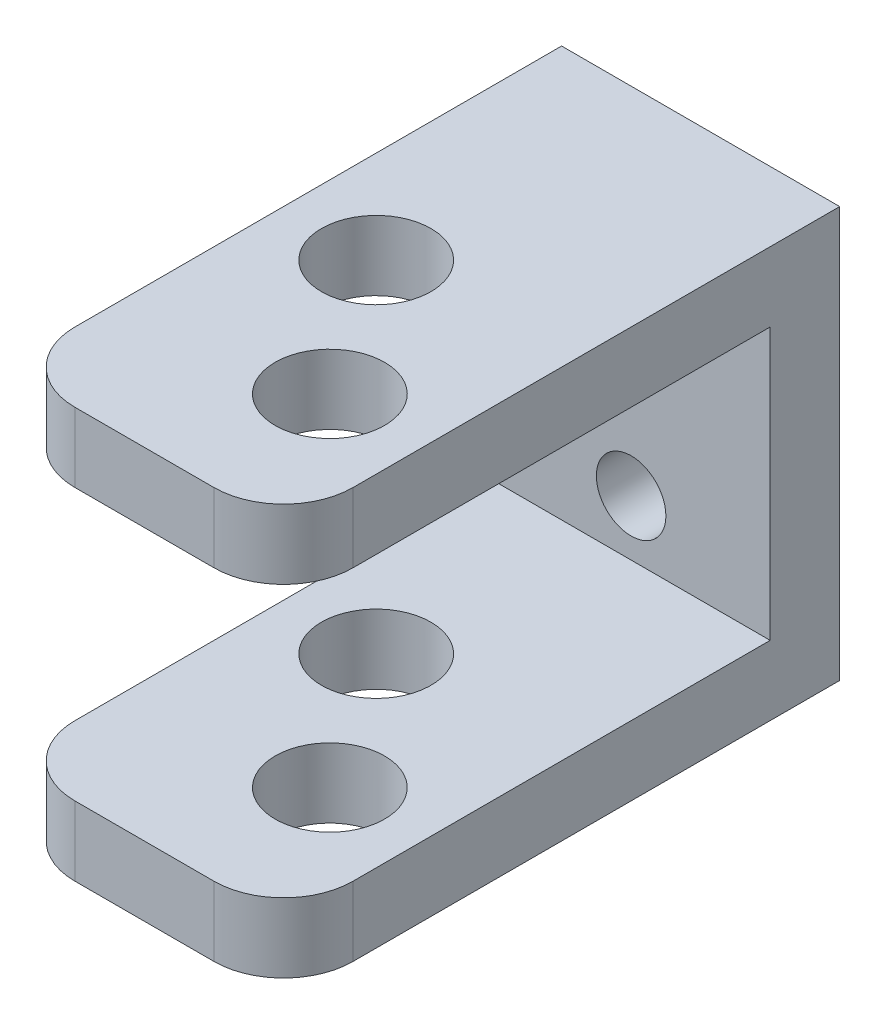
ISO-10303-21;
HEADER;
FILE_DESCRIPTION(('STEP AP214'),'2;1');
FILE_NAME('part.step','',(''),(''),'','','');
FILE_SCHEMA(('AUTOMOTIVE_DESIGN { 1 0 10303 214 1 1 1 1 }'));
ENDSEC;
DATA;
#1=APPLICATION_CONTEXT('core data for automotive mechanical design processes');
#2=APPLICATION_PROTOCOL_DEFINITION('international standard','automotive_design',2000,#1);
#3=PRODUCT_CONTEXT('',#1,'mechanical');
#4=PRODUCT('Part','Part','',(#3));
#5=PRODUCT_RELATED_PRODUCT_CATEGORY('part','',(#4));
#6=PRODUCT_DEFINITION_FORMATION('','',#4);
#7=PRODUCT_DEFINITION_CONTEXT('part definition',#1,'design');
#8=PRODUCT_DEFINITION('design','',#6,#7);
#9=PRODUCT_DEFINITION_SHAPE('','',#8);
#10=(LENGTH_UNIT() NAMED_UNIT(*) SI_UNIT(.MILLI.,.METRE.));
#11=(NAMED_UNIT(*) PLANE_ANGLE_UNIT() SI_UNIT($,.RADIAN.));
#12=(NAMED_UNIT(*) SI_UNIT($,.STERADIAN.) SOLID_ANGLE_UNIT());
#13=UNCERTAINTY_MEASURE_WITH_UNIT(LENGTH_MEASURE(1.E-05),#10,'distance_accuracy_value','');
#14=(GEOMETRIC_REPRESENTATION_CONTEXT(3) GLOBAL_UNCERTAINTY_ASSIGNED_CONTEXT((#13)) GLOBAL_UNIT_ASSIGNED_CONTEXT((#10,
#11,#12)) REPRESENTATION_CONTEXT('',''));
#15=CARTESIAN_POINT('',(0.,0.,0.));
#16=DIRECTION('',(0.,0.,1.));
#17=DIRECTION('',(1.,0.,0.));
#18=AXIS2_PLACEMENT_3D('',#15,#16,#17);
#19=CARTESIAN_POINT('',(0.,0.,6.35));
#20=DIRECTION('',(0.,0.,1.));
#21=DIRECTION('',(1.,0.,0.));
#22=AXIS2_PLACEMENT_3D('',#19,#20,#21);
#23=PLANE('',#22);
#24=CARTESIAN_POINT('',(-12.7,-11.43,6.35));
#25=DIRECTION('',(0.,0.,1.));
#26=DIRECTION('',(1.,0.,0.));
#27=AXIS2_PLACEMENT_3D('',#24,#25,#26);
#28=CIRCLE('',#27,3.175);
#29=CARTESIAN_POINT('',(-9.52500000000003,-11.43,6.35));
#30=VERTEX_POINT('',#29);
#31=EDGE_CURVE('E181',#30,#30,#28,.T.);
#32=ORIENTED_EDGE('',*,*,#31,.F.);
#33=EDGE_LOOP('',(#32));
#34=FACE_BOUND('',#33,.T.);
#35=CARTESIAN_POINT('',(-12.7,-26.0582354721947,6.35));
#36=DIRECTION('',(0.,0.,1.));
#37=DIRECTION('',(1.,0.,0.));
#38=AXIS2_PLACEMENT_3D('',#35,#36,#37);
#39=CIRCLE('',#38,3.175);
#40=CARTESIAN_POINT('',(-9.52500000000003,-26.0582354721947,6.35));
#41=VERTEX_POINT('',#40);
#42=EDGE_CURVE('E536',#41,#41,#39,.T.);
#43=ORIENTED_EDGE('',*,*,#42,.F.);
#44=EDGE_LOOP('',(#43));
#45=FACE_BOUND('',#44,.T.);
#46=DIRECTION('',(0.,-1.,0.));
#47=VECTOR('',#46,1.);
#48=CARTESIAN_POINT('',(-25.4,0.,6.35));
#49=LINE('',#48,#47);
#50=CARTESIAN_POINT('',(-25.4,-6.35,6.35));
#51=VERTEX_POINT('',#50);
#52=CARTESIAN_POINT('',(-25.4,-31.1382354721947,6.35));
#53=VERTEX_POINT('',#52);
#54=EDGE_CURVE('E130',#51,#53,#49,.T.);
#55=ORIENTED_EDGE('',*,*,#54,.T.);
#56=DIRECTION('',(-1.,0.,0.));
#57=VECTOR('',#56,1.);
#58=CARTESIAN_POINT('',(-25.4,-31.1382354721947,6.35));
#59=LINE('',#58,#57);
#60=CARTESIAN_POINT('',(0.,-31.1382354721947,6.35));
#61=VERTEX_POINT('',#60);
#62=EDGE_CURVE('E138',#61,#53,#59,.T.);
#63=ORIENTED_EDGE('',*,*,#62,.F.);
#64=DIRECTION('',(0.,-1.,0.));
#65=VECTOR('',#64,1.);
#66=CARTESIAN_POINT('',(0.,0.,6.35));
#67=LINE('',#66,#65);
#68=CARTESIAN_POINT('',(0.,-6.35,6.35));
#69=VERTEX_POINT('',#68);
#70=EDGE_CURVE('E152',#69,#61,#67,.T.);
#71=ORIENTED_EDGE('',*,*,#70,.F.);
#72=DIRECTION('',(1.,0.,0.));
#73=VECTOR('',#72,1.);
#74=CARTESIAN_POINT('',(0.,-6.35,6.35));
#75=LINE('',#74,#73);
#76=EDGE_CURVE('E150',#51,#69,#75,.T.);
#77=ORIENTED_EDGE('',*,*,#76,.F.);
#78=EDGE_LOOP('',(#55,#63,#71,#77));
#79=FACE_BOUND('',#78,.T.);
#80=ADVANCED_FACE('F39',(#34,#45,#79),#23,.T.);
#81=CARTESIAN_POINT('',(0.,0.,6.35));
#82=DIRECTION('',(1.,0.,0.));
#83=DIRECTION('',(0.,1.,0.));
#84=AXIS2_PLACEMENT_3D('',#81,#82,#83);
#85=PLANE('',#84);
#86=DIRECTION('',(0.,0.,-1.));
#87=VECTOR('',#86,1.);
#88=CARTESIAN_POINT('',(-8.67212955327729E-12,-31.1382354721947,50.8));
#89=LINE('',#88,#87);
#90=CARTESIAN_POINT('',(-8.67212955327729E-12,-31.1382354721947,44.45));
#91=VERTEX_POINT('',#90);
#92=EDGE_CURVE('E134',#91,#61,#89,.T.);
#93=ORIENTED_EDGE('',*,*,#92,.F.);
#94=DIRECTION('',(0.,1.,0.));
#95=VECTOR('',#94,1.);
#96=CARTESIAN_POINT('',(0.,-37.4882354721947,44.45));
#97=LINE('',#96,#95);
#98=CARTESIAN_POINT('',(-8.74753937398352E-12,-37.4882354721947,44.45));
#99=VERTEX_POINT('',#98);
#100=EDGE_CURVE('E204',#91,#99,#97,.F.);
#101=ORIENTED_EDGE('',*,*,#100,.T.);
#102=DIRECTION('',(0.,0.,-1.));
#103=VECTOR('',#102,1.);
#104=CARTESIAN_POINT('',(-8.74753937398352E-12,-37.4882354721947,6.35));
#105=LINE('',#104,#103);
#106=CARTESIAN_POINT('',(-8.74753937398352E-12,-37.4882354721947,0.));
#107=VERTEX_POINT('',#106);
#108=EDGE_CURVE('E151',#99,#107,#105,.T.);
#109=ORIENTED_EDGE('',*,*,#108,.T.);
#110=DIRECTION('',(0.,-1.,0.));
#111=VECTOR('',#110,1.);
#112=CARTESIAN_POINT('',(0.,0.,0.));
#113=LINE('',#112,#111);
#114=CARTESIAN_POINT('',(-8.67212955327729E-12,0.,0.));
#115=VERTEX_POINT('',#114);
#116=EDGE_CURVE('E160',#115,#107,#113,.T.);
#117=ORIENTED_EDGE('',*,*,#116,.F.);
#118=DIRECTION('',(0.,0.,-1.));
#119=VECTOR('',#118,1.);
#120=CARTESIAN_POINT('',(-8.67212955327729E-12,0.,6.35));
#121=LINE('',#120,#119);
#122=CARTESIAN_POINT('',(-8.67212955327729E-12,0.,44.45));
#123=VERTEX_POINT('',#122);
#124=EDGE_CURVE('E175',#123,#115,#121,.T.);
#125=ORIENTED_EDGE('',*,*,#124,.F.);
#126=DIRECTION('',(0.,1.,0.));
#127=VECTOR('',#126,1.);
#128=CARTESIAN_POINT('',(0.,-6.35,44.45));
#129=LINE('',#128,#127);
#130=CARTESIAN_POINT('',(0.,-6.35,44.45));
#131=VERTEX_POINT('',#130);
#132=EDGE_CURVE('E202',#123,#131,#129,.F.);
#133=ORIENTED_EDGE('',*,*,#132,.T.);
#134=DIRECTION('',(0.,0.,-1.));
#135=VECTOR('',#134,1.);
#136=CARTESIAN_POINT('',(0.,-6.35,50.8));
#137=LINE('',#136,#135);
#138=EDGE_CURVE('E227',#131,#69,#137,.T.);
#139=ORIENTED_EDGE('',*,*,#138,.T.);
#140=ORIENTED_EDGE('',*,*,#70,.T.);
#141=EDGE_LOOP('',(#93,#101,#109,#117,#125,#133,#139,#140));
#142=FACE_BOUND('',#141,.T.);
#143=ADVANCED_FACE('F245',(#142),#85,.T.);
#144=CARTESIAN_POINT('',(0.,0.,6.35));
#145=DIRECTION('',(0.,1.,0.));
#146=DIRECTION('',(-1.,0.,0.));
#147=AXIS2_PLACEMENT_3D('',#144,#145,#146);
#148=PLANE('',#147);
#149=CARTESIAN_POINT('',(-16.9333333333328,2.0122792321331E-13,25.4));
#150=DIRECTION('',(0.,1.,0.));
#151=DIRECTION('',(-1.,0.,0.));
#152=AXIS2_PLACEMENT_3D('',#149,#150,#151);
#153=CIRCLE('',#152,5.00000000001053);
#154=CARTESIAN_POINT('',(-21.9333333333433,2.60645617075653E-13,25.4));
#155=VERTEX_POINT('',#154);
#156=EDGE_CURVE('E564',#155,#155,#153,.T.);
#157=ORIENTED_EDGE('',*,*,#156,.F.);
#158=EDGE_LOOP('',(#157));
#159=FACE_BOUND('',#158,.T.);
#160=CARTESIAN_POINT('',(-8.46666666666551,1.00613961606655E-13,38.1));
#161=DIRECTION('',(0.,1.,0.));
#162=DIRECTION('',(-1.,0.,0.));
#163=AXIS2_PLACEMENT_3D('',#160,#161,#162);
#164=CIRCLE('',#163,5.00000000001011);
#165=CARTESIAN_POINT('',(-13.4666666666756,1.60031655468993E-13,38.1));
#166=VERTEX_POINT('',#165);
#167=EDGE_CURVE('E533',#166,#166,#164,.T.);
#168=ORIENTED_EDGE('',*,*,#167,.F.);
#169=EDGE_LOOP('',(#168));
#170=FACE_BOUND('',#169,.T.);
#171=DIRECTION('',(-1.,0.,0.));
#172=VECTOR('',#171,1.);
#173=CARTESIAN_POINT('',(0.,0.,50.8));
#174=LINE('',#173,#172);
#175=CARTESIAN_POINT('',(-6.35,0.,50.8));
#176=VERTEX_POINT('',#175);
#177=CARTESIAN_POINT('',(-19.05,0.,50.8));
#178=VERTEX_POINT('',#177);
#179=EDGE_CURVE('E236',#176,#178,#174,.T.);
#180=ORIENTED_EDGE('',*,*,#179,.F.);
#181=CARTESIAN_POINT('',(-6.35,0.,44.45));
#182=DIRECTION('',(0.,1.,0.));
#183=DIRECTION('',(-1.,0.,0.));
#184=AXIS2_PLACEMENT_3D('',#181,#182,#183);
#185=CIRCLE('',#184,6.35);
#186=EDGE_CURVE('E218',#176,#123,#185,.T.);
#187=ORIENTED_EDGE('',*,*,#186,.T.);
#188=ORIENTED_EDGE('',*,*,#124,.T.);
#189=DIRECTION('',(1.,0.,0.));
#190=VECTOR('',#189,1.);
#191=CARTESIAN_POINT('',(0.,0.,0.));
#192=LINE('',#191,#190);
#193=CARTESIAN_POINT('',(-25.4,3.01841884820068E-13,0.));
#194=VERTEX_POINT('',#193);
#195=EDGE_CURVE('E163',#194,#115,#192,.T.);
#196=ORIENTED_EDGE('',*,*,#195,.F.);
#197=DIRECTION('',(0.,0.,-1.));
#198=VECTOR('',#197,1.);
#199=CARTESIAN_POINT('',(-25.4,3.01841884820068E-13,6.35));
#200=LINE('',#199,#198);
#201=CARTESIAN_POINT('',(-25.4,3.01841884820068E-13,44.45));
#202=VERTEX_POINT('',#201);
#203=EDGE_CURVE('E173',#202,#194,#200,.T.);
#204=ORIENTED_EDGE('',*,*,#203,.F.);
#205=CARTESIAN_POINT('',(-19.05,2.26381413615051E-13,44.45));
#206=DIRECTION('',(0.,1.,0.));
#207=DIRECTION('',(-1.,0.,0.));
#208=AXIS2_PLACEMENT_3D('',#205,#206,#207);
#209=CIRCLE('',#208,6.35);
#210=EDGE_CURVE('E216',#202,#178,#209,.T.);
#211=ORIENTED_EDGE('',*,*,#210,.T.);
#212=EDGE_LOOP('',(#180,#187,#188,#196,#204,#211));
#213=FACE_BOUND('',#212,.T.);
#214=ADVANCED_FACE('F241',(#159,#170,#213),#148,.T.);
#215=CARTESIAN_POINT('',(-25.4,0.,6.35));
#216=DIRECTION('',(1.,0.,0.));
#217=DIRECTION('',(0.,1.,0.));
#218=AXIS2_PLACEMENT_3D('',#215,#216,#217);
#219=PLANE('',#218);
#220=DIRECTION('',(0.,0.,-1.));
#221=VECTOR('',#220,1.);
#222=CARTESIAN_POINT('',(-25.4,-37.4882354721947,6.35));
#223=LINE('',#222,#221);
#224=CARTESIAN_POINT('',(-25.4,-37.4882354721947,44.45));
#225=VERTEX_POINT('',#224);
#226=CARTESIAN_POINT('',(-25.4,-37.4882354721947,0.));
#227=VERTEX_POINT('',#226);
#228=EDGE_CURVE('E154',#225,#227,#223,.T.);
#229=ORIENTED_EDGE('',*,*,#228,.F.);
#230=DIRECTION('',(0.,-1.,0.));
#231=VECTOR('',#230,1.);
#232=CARTESIAN_POINT('',(-25.4,0.,44.45));
#233=LINE('',#232,#231);
#234=CARTESIAN_POINT('',(-25.4,-31.1382354721947,44.45));
#235=VERTEX_POINT('',#234);
#236=EDGE_CURVE('E11',#225,#235,#233,.F.);
#237=ORIENTED_EDGE('',*,*,#236,.T.);
#238=DIRECTION('',(0.,0.,-1.));
#239=VECTOR('',#238,1.);
#240=CARTESIAN_POINT('',(-25.4,-31.1382354721947,50.8));
#241=LINE('',#240,#239);
#242=EDGE_CURVE('E125',#235,#53,#241,.T.);
#243=ORIENTED_EDGE('',*,*,#242,.T.);
#244=ORIENTED_EDGE('',*,*,#54,.F.);
#245=DIRECTION('',(0.,0.,-1.));
#246=VECTOR('',#245,1.);
#247=CARTESIAN_POINT('',(-25.4,-6.35,50.8));
#248=LINE('',#247,#246);
#249=CARTESIAN_POINT('',(-25.4,-6.35,44.45));
#250=VERTEX_POINT('',#249);
#251=EDGE_CURVE('E164',#250,#51,#248,.T.);
#252=ORIENTED_EDGE('',*,*,#251,.F.);
#253=DIRECTION('',(0.,-1.,0.));
#254=VECTOR('',#253,1.);
#255=CARTESIAN_POINT('',(-25.4,0.,44.45));
#256=LINE('',#255,#254);
#257=EDGE_CURVE('E47',#250,#202,#256,.F.);
#258=ORIENTED_EDGE('',*,*,#257,.T.);
#259=ORIENTED_EDGE('',*,*,#203,.T.);
#260=DIRECTION('',(0.,-1.,0.));
#261=VECTOR('',#260,1.);
#262=CARTESIAN_POINT('',(-25.4,0.,0.));
#263=LINE('',#262,#261);
#264=EDGE_CURVE('E167',#194,#227,#263,.T.);
#265=ORIENTED_EDGE('',*,*,#264,.T.);
#266=EDGE_LOOP('',(#229,#237,#243,#244,#252,#258,#259,#265));
#267=FACE_BOUND('',#266,.T.);
#268=ADVANCED_FACE('F128',(#267),#219,.F.);
#269=CARTESIAN_POINT('',(0.,-37.4882354721947,6.35));
#270=DIRECTION('',(0.,1.,0.));
#271=DIRECTION('',(-1.,0.,0.));
#272=AXIS2_PLACEMENT_3D('',#269,#270,#271);
#273=PLANE('',#272);
#274=CARTESIAN_POINT('',(-16.9333333333332,-37.4882354721948,25.4));
#275=DIRECTION('',(0.,1.,0.));
#276=DIRECTION('',(-1.,0.,0.));
#277=AXIS2_PLACEMENT_3D('',#274,#275,#276);
#278=CIRCLE('',#277,5.00000000001053);
#279=CARTESIAN_POINT('',(-21.9333333333437,-37.4882354721948,25.4));
#280=VERTEX_POINT('',#279);
#281=EDGE_CURVE('E188',#280,#280,#278,.T.);
#282=ORIENTED_EDGE('',*,*,#281,.T.);
#283=EDGE_LOOP('',(#282));
#284=FACE_BOUND('',#283,.T.);
#285=CARTESIAN_POINT('',(-8.46666666666596,-37.4882354721949,38.1));
#286=DIRECTION('',(0.,1.,0.));
#287=DIRECTION('',(-1.,0.,0.));
#288=AXIS2_PLACEMENT_3D('',#285,#286,#287);
#289=CIRCLE('',#288,5.00000000001011);
#290=CARTESIAN_POINT('',(-13.4666666666761,-37.4882354721949,38.1));
#291=VERTEX_POINT('',#290);
#292=EDGE_CURVE('E561',#291,#291,#289,.T.);
#293=ORIENTED_EDGE('',*,*,#292,.T.);
#294=EDGE_LOOP('',(#293));
#295=FACE_BOUND('',#294,.T.);
#296=ORIENTED_EDGE('',*,*,#108,.F.);
#297=CARTESIAN_POINT('',(-6.35000000000008,-37.4882354721947,44.45));
#298=DIRECTION('',(0.,1.,0.));
#299=DIRECTION('',(-1.,0.,0.));
#300=AXIS2_PLACEMENT_3D('',#297,#298,#299);
#301=CIRCLE('',#300,6.35);
#302=CARTESIAN_POINT('',(-6.35000000000007,-37.4882354721947,50.8));
#303=VERTEX_POINT('',#302);
#304=EDGE_CURVE('E208',#99,#303,#301,.F.);
#305=ORIENTED_EDGE('',*,*,#304,.T.);
#306=DIRECTION('',(1.,0.,0.));
#307=VECTOR('',#306,1.);
#308=CARTESIAN_POINT('',(-25.4,-37.4882354721947,50.8));
#309=LINE('',#308,#307);
#310=CARTESIAN_POINT('',(-19.05,-37.4882354721947,50.8));
#311=VERTEX_POINT('',#310);
#312=EDGE_CURVE('E145',#311,#303,#309,.T.);
#313=ORIENTED_EDGE('',*,*,#312,.F.);
#314=CARTESIAN_POINT('',(-19.05,-37.4882354721947,44.45));
#315=DIRECTION('',(0.,1.,0.));
#316=DIRECTION('',(-1.,0.,0.));
#317=AXIS2_PLACEMENT_3D('',#314,#315,#316);
#318=CIRCLE('',#317,6.35);
#319=EDGE_CURVE('E206',#311,#225,#318,.F.);
#320=ORIENTED_EDGE('',*,*,#319,.T.);
#321=ORIENTED_EDGE('',*,*,#228,.T.);
#322=DIRECTION('',(1.,0.,0.));
#323=VECTOR('',#322,1.);
#324=CARTESIAN_POINT('',(0.,-37.4882354721947,0.));
#325=LINE('',#324,#323);
#326=EDGE_CURVE('E156',#227,#107,#325,.T.);
#327=ORIENTED_EDGE('',*,*,#326,.T.);
#328=EDGE_LOOP('',(#296,#305,#313,#320,#321,#327));
#329=FACE_BOUND('',#328,.T.);
#330=ADVANCED_FACE('F273',(#284,#295,#329),#273,.F.);
#331=CARTESIAN_POINT('',(0.,0.,0.));
#332=DIRECTION('',(0.,0.,1.));
#333=DIRECTION('',(1.,0.,0.));
#334=AXIS2_PLACEMENT_3D('',#331,#332,#333);
#335=PLANE('',#334);
#336=CARTESIAN_POINT('',(-12.7,-11.43,0.));
#337=DIRECTION('',(0.,0.,1.));
#338=DIRECTION('',(1.,0.,0.));
#339=AXIS2_PLACEMENT_3D('',#336,#337,#338);
#340=CIRCLE('',#339,3.175);
#341=CARTESIAN_POINT('',(-9.52500000000003,-11.43,0.));
#342=VERTEX_POINT('',#341);
#343=EDGE_CURVE('E146',#342,#342,#340,.T.);
#344=ORIENTED_EDGE('',*,*,#343,.T.);
#345=EDGE_LOOP('',(#344));
#346=FACE_BOUND('',#345,.T.);
#347=CARTESIAN_POINT('',(-12.7,-26.0582354721947,0.));
#348=DIRECTION('',(0.,0.,1.));
#349=DIRECTION('',(1.,0.,0.));
#350=AXIS2_PLACEMENT_3D('',#347,#348,#349);
#351=CIRCLE('',#350,3.175);
#352=CARTESIAN_POINT('',(-9.52500000000003,-26.0582354721947,0.));
#353=VERTEX_POINT('',#352);
#354=EDGE_CURVE('E178',#353,#353,#351,.T.);
#355=ORIENTED_EDGE('',*,*,#354,.T.);
#356=EDGE_LOOP('',(#355));
#357=FACE_BOUND('',#356,.T.);
#358=ORIENTED_EDGE('',*,*,#116,.T.);
#359=ORIENTED_EDGE('',*,*,#326,.F.);
#360=ORIENTED_EDGE('',*,*,#264,.F.);
#361=ORIENTED_EDGE('',*,*,#195,.T.);
#362=EDGE_LOOP('',(#358,#359,#360,#361));
#363=FACE_BOUND('',#362,.T.);
#364=ADVANCED_FACE('F250',(#346,#357,#363),#335,.F.);
#365=CARTESIAN_POINT('',(0.,-6.35,50.8));
#366=DIRECTION('',(0.,1.,0.));
#367=DIRECTION('',(-1.,0.,0.));
#368=AXIS2_PLACEMENT_3D('',#365,#366,#367);
#369=PLANE('',#368);
#370=CARTESIAN_POINT('',(-16.9333333333328,-6.35,25.4));
#371=DIRECTION('',(0.,1.,0.));
#372=DIRECTION('',(-1.,0.,0.));
#373=AXIS2_PLACEMENT_3D('',#370,#371,#372);
#374=CIRCLE('',#373,5.00000000001053);
#375=CARTESIAN_POINT('',(-21.9333333333434,-6.35000000000001,25.4));
#376=VERTEX_POINT('',#375);
#377=EDGE_CURVE('E192',#376,#376,#374,.T.);
#378=ORIENTED_EDGE('',*,*,#377,.T.);
#379=EDGE_LOOP('',(#378));
#380=FACE_BOUND('',#379,.T.);
#381=CARTESIAN_POINT('',(-8.46666666666559,-6.35,38.1));
#382=DIRECTION('',(0.,1.,0.));
#383=DIRECTION('',(-1.,0.,0.));
#384=AXIS2_PLACEMENT_3D('',#381,#382,#383);
#385=CIRCLE('',#384,5.00000000001011);
#386=CARTESIAN_POINT('',(-13.4666666666757,-6.35,38.1));
#387=VERTEX_POINT('',#386);
#388=EDGE_CURVE('E187',#387,#387,#385,.T.);
#389=ORIENTED_EDGE('',*,*,#388,.T.);
#390=EDGE_LOOP('',(#389));
#391=FACE_BOUND('',#390,.T.);
#392=ORIENTED_EDGE('',*,*,#138,.F.);
#393=CARTESIAN_POINT('',(-6.35000000000001,-6.35,44.45));
#394=DIRECTION('',(0.,1.,0.));
#395=DIRECTION('',(-1.,0.,0.));
#396=AXIS2_PLACEMENT_3D('',#393,#394,#395);
#397=CIRCLE('',#396,6.35);
#398=CARTESIAN_POINT('',(-6.35000000000001,-6.35,50.8));
#399=VERTEX_POINT('',#398);
#400=EDGE_CURVE('E221',#131,#399,#397,.F.);
#401=ORIENTED_EDGE('',*,*,#400,.T.);
#402=DIRECTION('',(1.,0.,0.));
#403=VECTOR('',#402,1.);
#404=CARTESIAN_POINT('',(0.,-6.35,50.8));
#405=LINE('',#404,#403);
#406=CARTESIAN_POINT('',(-19.05,-6.35,50.8));
#407=VERTEX_POINT('',#406);
#408=EDGE_CURVE('E226',#407,#399,#405,.T.);
#409=ORIENTED_EDGE('',*,*,#408,.F.);
#410=CARTESIAN_POINT('',(-19.05,-6.35,44.45));
#411=DIRECTION('',(0.,1.,0.));
#412=DIRECTION('',(-1.,0.,0.));
#413=AXIS2_PLACEMENT_3D('',#410,#411,#412);
#414=CIRCLE('',#413,6.35);
#415=EDGE_CURVE('E54',#407,#250,#414,.F.);
#416=ORIENTED_EDGE('',*,*,#415,.T.);
#417=ORIENTED_EDGE('',*,*,#251,.T.);
#418=ORIENTED_EDGE('',*,*,#76,.T.);
#419=EDGE_LOOP('',(#392,#401,#409,#416,#417,#418));
#420=FACE_BOUND('',#419,.T.);
#421=ADVANCED_FACE('F225',(#380,#391,#420),#369,.F.);
#422=CARTESIAN_POINT('',(0.,0.,50.8));
#423=DIRECTION('',(0.,0.,-1.));
#424=DIRECTION('',(-1.,0.,0.));
#425=AXIS2_PLACEMENT_3D('',#422,#423,#424);
#426=PLANE('',#425);
#427=ORIENTED_EDGE('',*,*,#408,.T.);
#428=DIRECTION('',(0.,1.,0.));
#429=VECTOR('',#428,1.);
#430=CARTESIAN_POINT('',(-6.35,0.,50.8));
#431=LINE('',#430,#429);
#432=EDGE_CURVE('E213',#399,#176,#431,.T.);
#433=ORIENTED_EDGE('',*,*,#432,.T.);
#434=ORIENTED_EDGE('',*,*,#179,.T.);
#435=DIRECTION('',(0.,-1.,0.));
#436=VECTOR('',#435,1.);
#437=CARTESIAN_POINT('',(-19.05,0.,50.8));
#438=LINE('',#437,#436);
#439=EDGE_CURVE('E210',#178,#407,#438,.T.);
#440=ORIENTED_EDGE('',*,*,#439,.T.);
#441=EDGE_LOOP('',(#427,#433,#434,#440));
#442=FACE_BOUND('',#441,.T.);
#443=ADVANCED_FACE('F232',(#442),#426,.F.);
#444=CARTESIAN_POINT('',(-25.4,-31.1382354721947,50.8));
#445=DIRECTION('',(0.,-1.,0.));
#446=DIRECTION('',(0.,0.,-1.));
#447=AXIS2_PLACEMENT_3D('',#444,#445,#446);
#448=PLANE('',#447);
#449=CARTESIAN_POINT('',(-16.9333333333331,-31.1382354721947,25.4));
#450=DIRECTION('',(0.,-1.,0.));
#451=DIRECTION('',(0.,0.,-1.));
#452=AXIS2_PLACEMENT_3D('',#449,#450,#451);
#453=CIRCLE('',#452,5.00000000001053);
#454=CARTESIAN_POINT('',(-16.9333333333331,-31.1382354721947,20.3999999999895));
#455=VERTEX_POINT('',#454);
#456=EDGE_CURVE('E189',#455,#455,#453,.T.);
#457=ORIENTED_EDGE('',*,*,#456,.T.);
#458=EDGE_LOOP('',(#457));
#459=FACE_BOUND('',#458,.T.);
#460=CARTESIAN_POINT('',(-8.46666666666588,-31.1382354721947,38.1));
#461=DIRECTION('',(0.,-1.,0.));
#462=DIRECTION('',(0.,0.,-1.));
#463=AXIS2_PLACEMENT_3D('',#460,#461,#462);
#464=CIRCLE('',#463,5.00000000001011);
#465=CARTESIAN_POINT('',(-8.46666666666588,-31.1382354721947,33.0999999999899));
#466=VERTEX_POINT('',#465);
#467=EDGE_CURVE('E184',#466,#466,#464,.T.);
#468=ORIENTED_EDGE('',*,*,#467,.T.);
#469=EDGE_LOOP('',(#468));
#470=FACE_BOUND('',#469,.T.);
#471=DIRECTION('',(-1.,0.,0.));
#472=VECTOR('',#471,1.);
#473=CARTESIAN_POINT('',(-25.4,-31.1382354721947,50.8));
#474=LINE('',#473,#472);
#475=CARTESIAN_POINT('',(-6.35000000000006,-31.1382354721947,50.8));
#476=VERTEX_POINT('',#475);
#477=CARTESIAN_POINT('',(-19.05,-31.1382354721947,50.8));
#478=VERTEX_POINT('',#477);
#479=EDGE_CURVE('E135',#476,#478,#474,.T.);
#480=ORIENTED_EDGE('',*,*,#479,.F.);
#481=CARTESIAN_POINT('',(-6.35000000000006,-31.1382354721947,44.45));
#482=DIRECTION('',(0.,-1.,0.));
#483=DIRECTION('',(0.,0.,-1.));
#484=AXIS2_PLACEMENT_3D('',#481,#482,#483);
#485=CIRCLE('',#484,6.35);
#486=EDGE_CURVE('E200',#476,#91,#485,.F.);
#487=ORIENTED_EDGE('',*,*,#486,.T.);
#488=ORIENTED_EDGE('',*,*,#92,.T.);
#489=ORIENTED_EDGE('',*,*,#62,.T.);
#490=ORIENTED_EDGE('',*,*,#242,.F.);
#491=CARTESIAN_POINT('',(-19.05,-31.1382354721947,44.45));
#492=DIRECTION('',(0.,-1.,0.));
#493=DIRECTION('',(0.,0.,-1.));
#494=AXIS2_PLACEMENT_3D('',#491,#492,#493);
#495=CIRCLE('',#494,6.35);
#496=EDGE_CURVE('E198',#235,#478,#495,.F.);
#497=ORIENTED_EDGE('',*,*,#496,.T.);
#498=EDGE_LOOP('',(#480,#487,#488,#489,#490,#497));
#499=FACE_BOUND('',#498,.T.);
#500=ADVANCED_FACE('F140',(#459,#470,#499),#448,.F.);
#501=CARTESIAN_POINT('',(0.,0.,50.8));
#502=DIRECTION('',(0.,0.,-1.));
#503=DIRECTION('',(-1.,0.,0.));
#504=AXIS2_PLACEMENT_3D('',#501,#502,#503);
#505=PLANE('',#504);
#506=ORIENTED_EDGE('',*,*,#312,.T.);
#507=DIRECTION('',(0.,1.,0.));
#508=VECTOR('',#507,1.);
#509=CARTESIAN_POINT('',(-6.35000000000006,-31.1382354721947,50.8));
#510=LINE('',#509,#508);
#511=EDGE_CURVE('E195',#303,#476,#510,.T.);
#512=ORIENTED_EDGE('',*,*,#511,.T.);
#513=ORIENTED_EDGE('',*,*,#479,.T.);
#514=DIRECTION('',(0.,-1.,0.));
#515=VECTOR('',#514,1.);
#516=CARTESIAN_POINT('',(-19.05,0.,50.8));
#517=LINE('',#516,#515);
#518=EDGE_CURVE('E177',#478,#311,#517,.T.);
#519=ORIENTED_EDGE('',*,*,#518,.T.);
#520=EDGE_LOOP('',(#506,#512,#513,#519));
#521=FACE_BOUND('',#520,.T.);
#522=ADVANCED_FACE('F371',(#521),#505,.F.);
#523=CARTESIAN_POINT('',(-12.7,-26.0582354721947,-31.75));
#524=DIRECTION('',(0.,0.,1.));
#525=DIRECTION('',(1.,0.,0.));
#526=AXIS2_PLACEMENT_3D('',#523,#524,#525);
#527=CYLINDRICAL_SURFACE('',#526,3.175);
#528=ORIENTED_EDGE('',*,*,#42,.T.);
#529=EDGE_LOOP('',(#528));
#530=FACE_BOUND('',#529,.T.);
#531=ORIENTED_EDGE('',*,*,#354,.F.);
#532=EDGE_LOOP('',(#531));
#533=FACE_BOUND('',#532,.T.);
#534=ADVANCED_FACE('F361',(#530,#533),#527,.F.);
#535=CARTESIAN_POINT('',(-12.7,-11.43,-31.75));
#536=DIRECTION('',(0.,0.,1.));
#537=DIRECTION('',(1.,0.,0.));
#538=AXIS2_PLACEMENT_3D('',#535,#536,#537);
#539=CYLINDRICAL_SURFACE('',#538,3.175);
#540=ORIENTED_EDGE('',*,*,#31,.T.);
#541=EDGE_LOOP('',(#540));
#542=FACE_BOUND('',#541,.T.);
#543=ORIENTED_EDGE('',*,*,#343,.F.);
#544=EDGE_LOOP('',(#543));
#545=FACE_BOUND('',#544,.T.);
#546=ADVANCED_FACE('F352',(#542,#545),#539,.F.);
#547=CARTESIAN_POINT('',(-8.46666666666596,-37.4882354721949,38.1));
#548=DIRECTION('',(0.,1.,0.));
#549=DIRECTION('',(-1.,0.,0.));
#550=AXIS2_PLACEMENT_3D('',#547,#548,#549);
#551=CYLINDRICAL_SURFACE('',#550,5.00000000001011);
#552=ORIENTED_EDGE('',*,*,#292,.F.);
#553=EDGE_LOOP('',(#552));
#554=FACE_BOUND('',#553,.T.);
#555=ORIENTED_EDGE('',*,*,#467,.F.);
#556=EDGE_LOOP('',(#555));
#557=FACE_BOUND('',#556,.T.);
#558=ADVANCED_FACE('F336',(#554,#557),#551,.F.);
#559=CARTESIAN_POINT('',(-16.9333333333332,-37.4882354721948,25.4));
#560=DIRECTION('',(0.,1.,0.));
#561=DIRECTION('',(-1.,0.,0.));
#562=AXIS2_PLACEMENT_3D('',#559,#560,#561);
#563=CYLINDRICAL_SURFACE('',#562,5.00000000001053);
#564=ORIENTED_EDGE('',*,*,#281,.F.);
#565=EDGE_LOOP('',(#564));
#566=FACE_BOUND('',#565,.T.);
#567=ORIENTED_EDGE('',*,*,#456,.F.);
#568=EDGE_LOOP('',(#567));
#569=FACE_BOUND('',#568,.T.);
#570=ADVANCED_FACE('F326',(#566,#569),#563,.F.);
#571=ORIENTED_EDGE('',*,*,#167,.T.);
#572=EDGE_LOOP('',(#571));
#573=FACE_BOUND('',#572,.T.);
#574=ORIENTED_EDGE('',*,*,#388,.F.);
#575=EDGE_LOOP('',(#574));
#576=FACE_BOUND('',#575,.T.);
#577=ADVANCED_FACE('F323',(#573,#576),#551,.F.);
#578=ORIENTED_EDGE('',*,*,#156,.T.);
#579=EDGE_LOOP('',(#578));
#580=FACE_BOUND('',#579,.T.);
#581=ORIENTED_EDGE('',*,*,#377,.F.);
#582=EDGE_LOOP('',(#581));
#583=FACE_BOUND('',#582,.T.);
#584=ADVANCED_FACE('F286',(#580,#583),#563,.F.);
#585=CARTESIAN_POINT('',(-6.35,0.,44.45));
#586=DIRECTION('',(0.,-1.,0.));
#587=DIRECTION('',(1.,0.,0.));
#588=AXIS2_PLACEMENT_3D('',#585,#586,#587);
#589=CYLINDRICAL_SURFACE('',#588,6.35);
#590=ORIENTED_EDGE('',*,*,#304,.F.);
#591=ORIENTED_EDGE('',*,*,#100,.F.);
#592=ORIENTED_EDGE('',*,*,#486,.F.);
#593=ORIENTED_EDGE('',*,*,#511,.F.);
#594=EDGE_LOOP('',(#590,#591,#592,#593));
#595=FACE_BOUND('',#594,.T.);
#596=ADVANCED_FACE('F283',(#595),#589,.T.);
#597=CARTESIAN_POINT('',(-6.35,0.,44.45));
#598=DIRECTION('',(0.,-1.,0.));
#599=DIRECTION('',(1.,0.,0.));
#600=AXIS2_PLACEMENT_3D('',#597,#598,#599);
#601=CYLINDRICAL_SURFACE('',#600,6.35);
#602=ORIENTED_EDGE('',*,*,#400,.F.);
#603=ORIENTED_EDGE('',*,*,#132,.F.);
#604=ORIENTED_EDGE('',*,*,#186,.F.);
#605=ORIENTED_EDGE('',*,*,#432,.F.);
#606=EDGE_LOOP('',(#602,#603,#604,#605));
#607=FACE_BOUND('',#606,.T.);
#608=ADVANCED_FACE('F238',(#607),#601,.T.);
#609=CARTESIAN_POINT('',(-19.05,0.,44.45));
#610=DIRECTION('',(0.,-1.,0.));
#611=DIRECTION('',(1.,0.,0.));
#612=AXIS2_PLACEMENT_3D('',#609,#610,#611);
#613=CYLINDRICAL_SURFACE('',#612,6.35);
#614=ORIENTED_EDGE('',*,*,#496,.F.);
#615=ORIENTED_EDGE('',*,*,#236,.F.);
#616=ORIENTED_EDGE('',*,*,#319,.F.);
#617=ORIENTED_EDGE('',*,*,#518,.F.);
#618=EDGE_LOOP('',(#614,#615,#616,#617));
#619=FACE_BOUND('',#618,.T.);
#620=ADVANCED_FACE('F254',(#619),#613,.T.);
#621=CARTESIAN_POINT('',(-19.05,0.,44.45));
#622=DIRECTION('',(0.,-1.,0.));
#623=DIRECTION('',(1.,0.,0.));
#624=AXIS2_PLACEMENT_3D('',#621,#622,#623);
#625=CYLINDRICAL_SURFACE('',#624,6.35);
#626=ORIENTED_EDGE('',*,*,#210,.F.);
#627=ORIENTED_EDGE('',*,*,#257,.F.);
#628=ORIENTED_EDGE('',*,*,#415,.F.);
#629=ORIENTED_EDGE('',*,*,#439,.F.);
#630=EDGE_LOOP('',(#626,#627,#628,#629));
#631=FACE_BOUND('',#630,.T.);
#632=ADVANCED_FACE('F41',(#631),#625,.T.);
#633=CLOSED_SHELL('',(#80,#143,#214,#268,#330,#364,#421,#443,#500,#522,#534,#546,#558,#570,#577,
#584,#596,#608,#620,#632));
#634=MANIFOLD_SOLID_BREP('B2',#633);
#635=ADVANCED_BREP_SHAPE_REPRESENTATION('',(#18,#634),#14);
#636=SHAPE_DEFINITION_REPRESENTATION(#9,#635);
ENDSEC;
END-ISO-10303-21;
